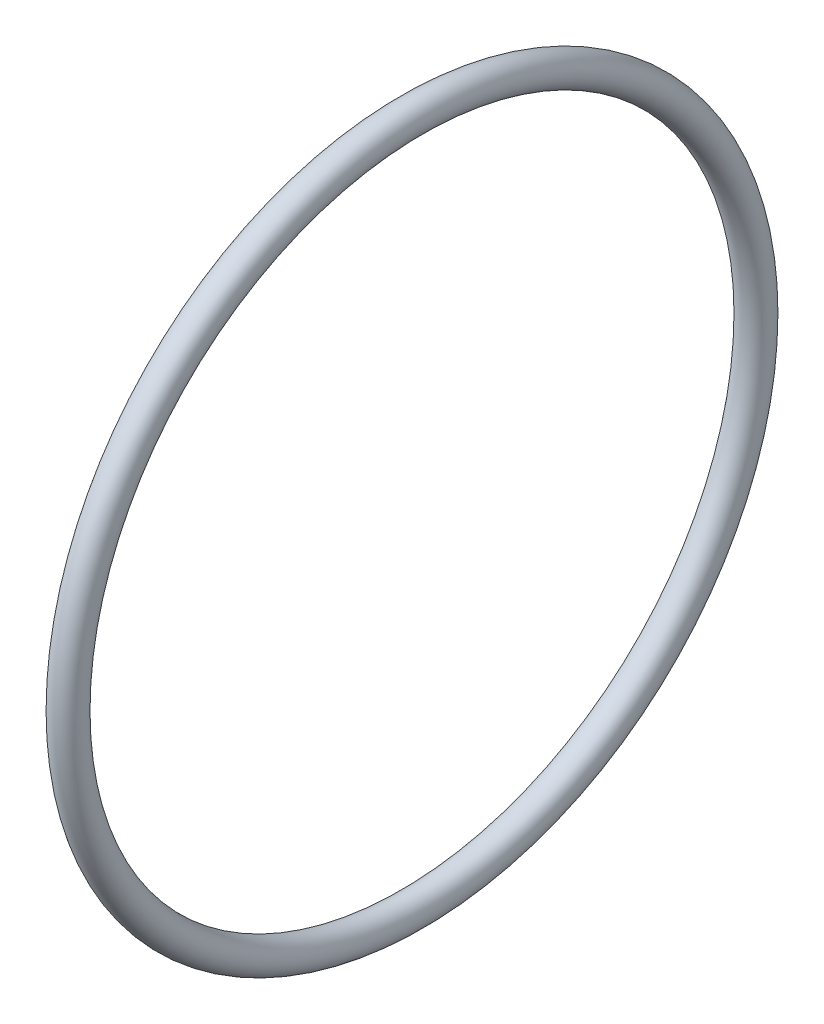
ISO-10303-21;
HEADER;
FILE_DESCRIPTION(('STEP AP214'),'2;1');
FILE_NAME('part.step','',(''),(''),'','','');
FILE_SCHEMA(('AUTOMOTIVE_DESIGN { 1 0 10303 214 1 1 1 1 }'));
ENDSEC;
DATA;
#1=APPLICATION_CONTEXT('core data for automotive mechanical design processes');
#2=APPLICATION_PROTOCOL_DEFINITION('international standard','automotive_design',2000,#1);
#3=PRODUCT_CONTEXT('',#1,'mechanical');
#4=PRODUCT('Part','Part','',(#3));
#5=PRODUCT_RELATED_PRODUCT_CATEGORY('part','',(#4));
#6=PRODUCT_DEFINITION_FORMATION('','',#4);
#7=PRODUCT_DEFINITION_CONTEXT('part definition',#1,'design');
#8=PRODUCT_DEFINITION('design','',#6,#7);
#9=PRODUCT_DEFINITION_SHAPE('','',#8);
#10=(LENGTH_UNIT() NAMED_UNIT(*) SI_UNIT(.MILLI.,.METRE.));
#11=(NAMED_UNIT(*) PLANE_ANGLE_UNIT() SI_UNIT($,.RADIAN.));
#12=(NAMED_UNIT(*) SI_UNIT($,.STERADIAN.) SOLID_ANGLE_UNIT());
#13=UNCERTAINTY_MEASURE_WITH_UNIT(LENGTH_MEASURE(1.E-05),#10,'distance_accuracy_value','');
#14=(GEOMETRIC_REPRESENTATION_CONTEXT(3) GLOBAL_UNCERTAINTY_ASSIGNED_CONTEXT((#13)) GLOBAL_UNIT_ASSIGNED_CONTEXT((#10,
#11,#12)) REPRESENTATION_CONTEXT('',''));
#15=CARTESIAN_POINT('',(0.,0.,0.));
#16=DIRECTION('',(0.,0.,1.));
#17=DIRECTION('',(1.,0.,0.));
#18=AXIS2_PLACEMENT_3D('',#15,#16,#17);
#19=CARTESIAN_POINT('',(2.54,0.,0.));
#20=DIRECTION('',(-1.,0.,0.));
#21=DIRECTION('',(0.,0.,1.));
#22=AXIS2_PLACEMENT_3D('',#19,#20,#21);
#23=TOROIDAL_SURFACE('',#22,22.479,1.016);
#24=CARTESIAN_POINT('',(2.54,0.,23.495));
#25=VERTEX_POINT('',#24);
#26=VERTEX_LOOP('',#25);
#27=FACE_BOUND('',#26,.T.);
#28=ADVANCED_FACE('F27',(#27),#23,.T.);
#29=CLOSED_SHELL('',(#28));
#30=MANIFOLD_SOLID_BREP('B2',#29);
#31=ADVANCED_BREP_SHAPE_REPRESENTATION('',(#18,#30),#14);
#32=SHAPE_DEFINITION_REPRESENTATION(#9,#31);
ENDSEC;
END-ISO-10303-21;
